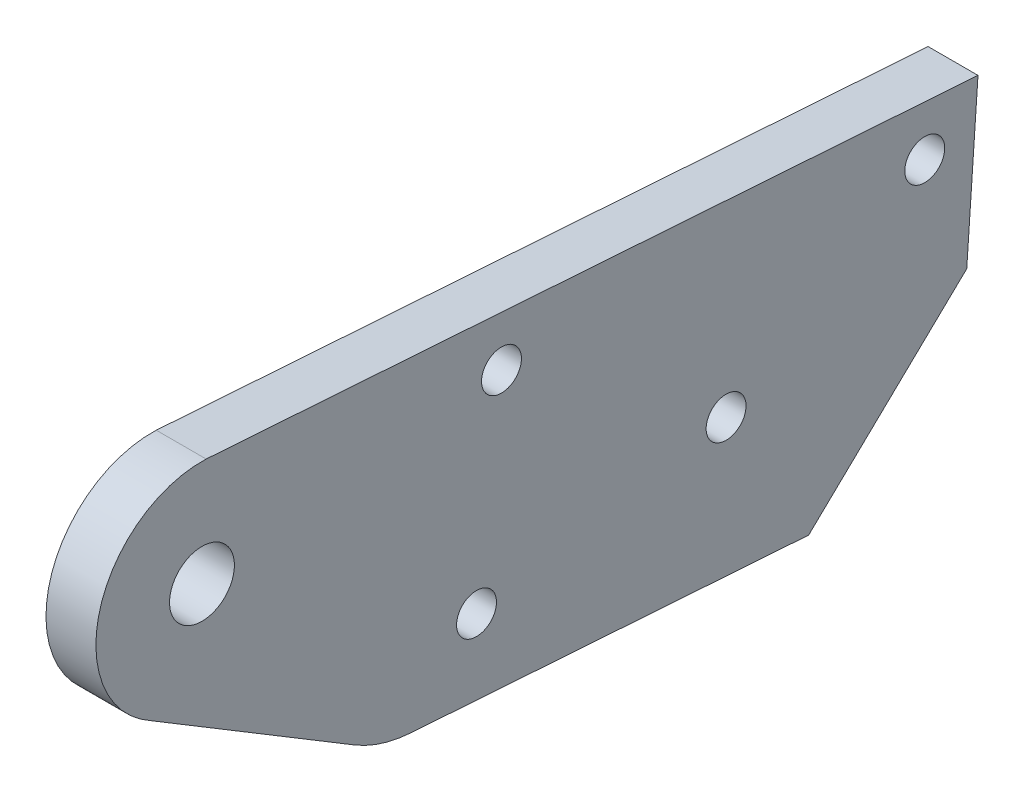
ISO-10303-21;
HEADER;
FILE_DESCRIPTION(('STEP AP214'),'2;1');
FILE_NAME('part.step','',(''),(''),'','','');
FILE_SCHEMA(('AUTOMOTIVE_DESIGN { 1 0 10303 214 1 1 1 1 }'));
ENDSEC;
DATA;
#1=APPLICATION_CONTEXT('core data for automotive mechanical design processes');
#2=APPLICATION_PROTOCOL_DEFINITION('international standard','automotive_design',2000,#1);
#3=PRODUCT_CONTEXT('',#1,'mechanical');
#4=PRODUCT('Part','Part','',(#3));
#5=PRODUCT_RELATED_PRODUCT_CATEGORY('part','',(#4));
#6=PRODUCT_DEFINITION_FORMATION('','',#4);
#7=PRODUCT_DEFINITION_CONTEXT('part definition',#1,'design');
#8=PRODUCT_DEFINITION('design','',#6,#7);
#9=PRODUCT_DEFINITION_SHAPE('','',#8);
#10=(LENGTH_UNIT() NAMED_UNIT(*) SI_UNIT(.MILLI.,.METRE.));
#11=(NAMED_UNIT(*) PLANE_ANGLE_UNIT() SI_UNIT($,.RADIAN.));
#12=(NAMED_UNIT(*) SI_UNIT($,.STERADIAN.) SOLID_ANGLE_UNIT());
#13=UNCERTAINTY_MEASURE_WITH_UNIT(LENGTH_MEASURE(1.E-05),#10,'distance_accuracy_value','');
#14=(GEOMETRIC_REPRESENTATION_CONTEXT(3) GLOBAL_UNCERTAINTY_ASSIGNED_CONTEXT((#13)) GLOBAL_UNIT_ASSIGNED_CONTEXT((#10,
#11,#12)) REPRESENTATION_CONTEXT('',''));
#15=CARTESIAN_POINT('',(0.,0.,0.));
#16=DIRECTION('',(0.,0.,1.));
#17=DIRECTION('',(1.,0.,0.));
#18=AXIS2_PLACEMENT_3D('',#15,#16,#17);
#19=CARTESIAN_POINT('',(4.,11.0855483547425,15.2679604949274));
#20=DIRECTION('',(-1.,0.,0.));
#21=DIRECTION('',(0.,0.,1.));
#22=AXIS2_PLACEMENT_3D('',#19,#20,#21);
#23=PLANE('',#22);
#24=DIRECTION('',(0.,0.997592279399619,-0.0693515975466527));
#25=VECTOR('',#24,1.);
#26=CARTESIAN_POINT('',(4.,24.0097437276074,-29.531620026455));
#27=LINE('',#26,#25);
#28=CARTESIAN_POINT('',(4.,11.0410440954124,-28.6300492583485));
#29=VERTEX_POINT('',#28);
#30=CARTESIAN_POINT('',(4.,24.0097437276074,-29.531620026455));
#31=VERTEX_POINT('',#30);
#32=EDGE_CURVE('E139',#29,#31,#27,.T.);
#33=ORIENTED_EDGE('',*,*,#32,.T.);
#34=DIRECTION('',(0.,0.0693515975466529,0.997592279399619));
#35=VECTOR('',#34,1.);
#36=CARTESIAN_POINT('',(4.,24.0097437276074,-29.531620026455));
#37=LINE('',#36,#35);
#38=CARTESIAN_POINT('',(4.,28.3095427754999,32.3191012963214));
#39=VERTEX_POINT('',#38);
#40=EDGE_CURVE('E92',#31,#39,#37,.T.);
#41=ORIENTED_EDGE('',*,*,#40,.T.);
#42=CARTESIAN_POINT('',(4.,19.8161543742446,32.6542929809171));
#43=DIRECTION('',(1.,0.,0.));
#44=DIRECTION('',(0.,0.,-1.));
#45=AXIS2_PLACEMENT_3D('',#42,#43,#44);
#46=CIRCLE('',#45,8.5);
#47=CARTESIAN_POINT('',(4.,12.3842742548523,36.7794787817001));
#48=VERTEX_POINT('',#47);
#49=EDGE_CURVE('E151',#39,#48,#46,.T.);
#50=ORIENTED_EDGE('',*,*,#49,.T.);
#51=DIRECTION('',(0.,-0.516562038928992,-0.856249764926988));
#52=VECTOR('',#51,1.);
#53=CARTESIAN_POINT('',(4.,2.52305070547264,20.4335808842173));
#54=LINE('',#53,#52);
#55=CARTESIAN_POINT('',(4.,2.52305070547264,20.4335808842173));
#56=VERTEX_POINT('',#55);
#57=EDGE_CURVE('E108',#48,#56,#54,.T.);
#58=ORIENTED_EDGE('',*,*,#57,.T.);
#59=CARTESIAN_POINT('',(4.,11.0855483547425,15.2679604949274));
#60=DIRECTION('',(1.,0.,0.));
#61=DIRECTION('',(0.,0.,1.));
#62=AXIS2_PLACEMENT_3D('',#59,#60,#61);
#63=CIRCLE('',#62,10.);
#64=CARTESIAN_POINT('',(4.,1.10962556074634,15.9614764703939));
#65=VERTEX_POINT('',#64);
#66=EDGE_CURVE('E102',#56,#65,#63,.T.);
#67=ORIENTED_EDGE('',*,*,#66,.T.);
#68=DIRECTION('',(0.,-0.0693515975466525,-0.997592279399619));
#69=VECTOR('',#68,1.);
#70=CARTESIAN_POINT('',(4.,-1.10962556074654,-15.9614764703939));
#71=LINE('',#70,#69);
#72=CARTESIAN_POINT('',(4.,-1.10962556074654,-15.9614764703939));
#73=VERTEX_POINT('',#72);
#74=EDGE_CURVE('E106',#65,#73,#71,.T.);
#75=ORIENTED_EDGE('',*,*,#74,.T.);
#76=DIRECTION('',(0.,0.692200897290571,-0.721704868897342));
#77=VECTOR('',#76,1.);
#78=CARTESIAN_POINT('',(4.,-1.10962556074654,-15.9614764703939));
#79=LINE('',#78,#77);
#80=EDGE_CURVE('E52',#73,#29,#79,.T.);
#81=ORIENTED_EDGE('',*,*,#80,.T.);
#82=EDGE_LOOP('',(#33,#41,#50,#58,#67,#75,#81));
#83=FACE_BOUND('',#82,.T.);
#84=CARTESIAN_POINT('',(4.,20.2967810001956,-25.2638445186699));
#85=DIRECTION('',(1.,0.,0.));
#86=DIRECTION('',(0.,0.,-1.));
#87=AXIS2_PLACEMENT_3D('',#84,#85,#86);
#88=CIRCLE('',#87,1.60000000000001);
#89=CARTESIAN_POINT('',(4.,20.2967810001956,-26.8638445186699));
#90=VERTEX_POINT('',#89);
#91=EDGE_CURVE('E130',#90,#90,#88,.T.);
#92=ORIENTED_EDGE('',*,*,#91,.F.);
#93=EDGE_LOOP('',(#92));
#94=FACE_BOUND('',#93,.T.);
#95=CARTESIAN_POINT('',(4.,22.6547353167818,8.65429298091723));
#96=DIRECTION('',(1.,0.,0.));
#97=DIRECTION('',(0.,0.,-1.));
#98=AXIS2_PLACEMENT_3D('',#95,#96,#97);
#99=CIRCLE('',#98,1.60000000000001);
#100=CARTESIAN_POINT('',(4.,22.6547353167818,7.05429298091722));
#101=VERTEX_POINT('',#100);
#102=EDGE_CURVE('E166',#101,#101,#99,.T.);
#103=ORIENTED_EDGE('',*,*,#102,.F.);
#104=EDGE_LOOP('',(#103));
#105=FACE_BOUND('',#104,.T.);
#106=CARTESIAN_POINT('',(4.,10.3768448310903,-9.34570701908289));
#107=DIRECTION('',(1.,0.,0.));
#108=DIRECTION('',(0.,0.,-1.));
#109=AXIS2_PLACEMENT_3D('',#106,#107,#108);
#110=CIRCLE('',#109,1.60000000000001);
#111=CARTESIAN_POINT('',(4.,10.3768448310903,-10.9457070190829));
#112=VERTEX_POINT('',#111);
#113=EDGE_CURVE('E172',#112,#112,#110,.T.);
#114=ORIENTED_EDGE('',*,*,#113,.F.);
#115=EDGE_LOOP('',(#114));
#116=FACE_BOUND('',#115,.T.);
#117=CARTESIAN_POINT('',(4.,6.75515676906828,10.6542929809171));
#118=DIRECTION('',(1.,0.,0.));
#119=DIRECTION('',(0.,0.,-1.));
#120=AXIS2_PLACEMENT_3D('',#117,#118,#119);
#121=CIRCLE('',#120,1.60000000000001);
#122=CARTESIAN_POINT('',(4.,6.75515676906828,9.0542929809171));
#123=VERTEX_POINT('',#122);
#124=EDGE_CURVE('E178',#123,#123,#121,.T.);
#125=ORIENTED_EDGE('',*,*,#124,.F.);
#126=EDGE_LOOP('',(#125));
#127=FACE_BOUND('',#126,.T.);
#128=CARTESIAN_POINT('',(4.,19.8161543742446,32.6542929809171));
#129=DIRECTION('',(1.,0.,0.));
#130=DIRECTION('',(0.,0.,-1.));
#131=AXIS2_PLACEMENT_3D('',#128,#129,#130);
#132=CIRCLE('',#131,2.6);
#133=CARTESIAN_POINT('',(4.,19.8161543742446,30.0542929809171));
#134=VERTEX_POINT('',#133);
#135=EDGE_CURVE('E184',#134,#134,#132,.T.);
#136=ORIENTED_EDGE('',*,*,#135,.F.);
#137=EDGE_LOOP('',(#136));
#138=FACE_BOUND('',#137,.T.);
#139=ADVANCED_FACE('F35',(#83,#94,#105,#116,#127,#138),#23,.F.);
#140=CARTESIAN_POINT('',(0.,11.0855483547425,15.2679604949274));
#141=DIRECTION('',(-1.,0.,0.));
#142=DIRECTION('',(0.,0.,1.));
#143=AXIS2_PLACEMENT_3D('',#140,#141,#142);
#144=PLANE('',#143);
#145=CARTESIAN_POINT('',(0.,6.75515676906828,10.6542929809171));
#146=DIRECTION('',(1.,0.,0.));
#147=DIRECTION('',(0.,0.,-1.));
#148=AXIS2_PLACEMENT_3D('',#145,#146,#147);
#149=CIRCLE('',#148,1.60000000000001);
#150=CARTESIAN_POINT('',(0.,6.75515676906828,9.0542929809171));
#151=VERTEX_POINT('',#150);
#152=EDGE_CURVE('E181',#151,#151,#149,.T.);
#153=ORIENTED_EDGE('',*,*,#152,.T.);
#154=EDGE_LOOP('',(#153));
#155=FACE_BOUND('',#154,.T.);
#156=CARTESIAN_POINT('',(0.,22.6547353167818,8.65429298091723));
#157=DIRECTION('',(1.,0.,0.));
#158=DIRECTION('',(0.,0.,-1.));
#159=AXIS2_PLACEMENT_3D('',#156,#157,#158);
#160=CIRCLE('',#159,1.60000000000001);
#161=CARTESIAN_POINT('',(0.,22.6547353167818,7.05429298091722));
#162=VERTEX_POINT('',#161);
#163=EDGE_CURVE('E169',#162,#162,#160,.T.);
#164=ORIENTED_EDGE('',*,*,#163,.T.);
#165=EDGE_LOOP('',(#164));
#166=FACE_BOUND('',#165,.T.);
#167=DIRECTION('',(0.,0.997592279399619,-0.0693515975466527));
#168=VECTOR('',#167,1.);
#169=CARTESIAN_POINT('',(0.,24.0097437276074,-29.531620026455));
#170=LINE('',#169,#168);
#171=CARTESIAN_POINT('',(0.,11.0410440954124,-28.6300492583485));
#172=VERTEX_POINT('',#171);
#173=CARTESIAN_POINT('',(0.,24.0097437276074,-29.531620026455));
#174=VERTEX_POINT('',#173);
#175=EDGE_CURVE('E126',#172,#174,#170,.T.);
#176=ORIENTED_EDGE('',*,*,#175,.F.);
#177=DIRECTION('',(0.,0.692200897290571,-0.721704868897342));
#178=VECTOR('',#177,1.);
#179=CARTESIAN_POINT('',(0.,-1.10962556074654,-15.9614764703939));
#180=LINE('',#179,#178);
#181=CARTESIAN_POINT('',(0.,-1.10962556074654,-15.9614764703939));
#182=VERTEX_POINT('',#181);
#183=EDGE_CURVE('E84',#182,#172,#180,.T.);
#184=ORIENTED_EDGE('',*,*,#183,.F.);
#185=DIRECTION('',(0.,-0.0693515975466525,-0.997592279399619));
#186=VECTOR('',#185,1.);
#187=CARTESIAN_POINT('',(0.,-1.10962556074654,-15.9614764703939));
#188=LINE('',#187,#186);
#189=CARTESIAN_POINT('',(0.,1.10962556074634,15.9614764703939));
#190=VERTEX_POINT('',#189);
#191=EDGE_CURVE('E78',#190,#182,#188,.T.);
#192=ORIENTED_EDGE('',*,*,#191,.F.);
#193=CARTESIAN_POINT('',(0.,11.0855483547425,15.2679604949274));
#194=DIRECTION('',(1.,0.,0.));
#195=DIRECTION('',(0.,0.,1.));
#196=AXIS2_PLACEMENT_3D('',#193,#194,#195);
#197=CIRCLE('',#196,10.);
#198=CARTESIAN_POINT('',(0.,2.52305070547264,20.4335808842173));
#199=VERTEX_POINT('',#198);
#200=EDGE_CURVE('E116',#199,#190,#197,.T.);
#201=ORIENTED_EDGE('',*,*,#200,.F.);
#202=DIRECTION('',(0.,-0.516562038928992,-0.856249764926988));
#203=VECTOR('',#202,1.);
#204=CARTESIAN_POINT('',(0.,2.52305070547264,20.4335808842173));
#205=LINE('',#204,#203);
#206=CARTESIAN_POINT('',(0.,12.3842742548523,36.7794787817001));
#207=VERTEX_POINT('',#206);
#208=EDGE_CURVE('E134',#207,#199,#205,.T.);
#209=ORIENTED_EDGE('',*,*,#208,.F.);
#210=CARTESIAN_POINT('',(0.,19.8161543742446,32.6542929809171));
#211=DIRECTION('',(1.,0.,0.));
#212=DIRECTION('',(0.,0.,-1.));
#213=AXIS2_PLACEMENT_3D('',#210,#211,#212);
#214=CIRCLE('',#213,8.5);
#215=CARTESIAN_POINT('',(0.,28.3095427754999,32.3191012963214));
#216=VERTEX_POINT('',#215);
#217=EDGE_CURVE('E132',#216,#207,#214,.T.);
#218=ORIENTED_EDGE('',*,*,#217,.F.);
#219=DIRECTION('',(0.,0.0693515975466529,0.997592279399619));
#220=VECTOR('',#219,1.);
#221=CARTESIAN_POINT('',(0.,24.0097437276074,-29.531620026455));
#222=LINE('',#221,#220);
#223=EDGE_CURVE('E129',#174,#216,#222,.T.);
#224=ORIENTED_EDGE('',*,*,#223,.F.);
#225=EDGE_LOOP('',(#176,#184,#192,#201,#209,#218,#224));
#226=FACE_BOUND('',#225,.T.);
#227=CARTESIAN_POINT('',(0.,20.2967810001956,-25.2638445186699));
#228=DIRECTION('',(1.,0.,0.));
#229=DIRECTION('',(0.,0.,-1.));
#230=AXIS2_PLACEMENT_3D('',#227,#228,#229);
#231=CIRCLE('',#230,1.60000000000001);
#232=CARTESIAN_POINT('',(0.,20.2967810001956,-26.8638445186699));
#233=VERTEX_POINT('',#232);
#234=EDGE_CURVE('E163',#233,#233,#231,.T.);
#235=ORIENTED_EDGE('',*,*,#234,.T.);
#236=EDGE_LOOP('',(#235));
#237=FACE_BOUND('',#236,.T.);
#238=CARTESIAN_POINT('',(0.,10.3768448310903,-9.34570701908289));
#239=DIRECTION('',(1.,0.,0.));
#240=DIRECTION('',(0.,0.,-1.));
#241=AXIS2_PLACEMENT_3D('',#238,#239,#240);
#242=CIRCLE('',#241,1.60000000000001);
#243=CARTESIAN_POINT('',(0.,10.3768448310903,-10.9457070190829));
#244=VERTEX_POINT('',#243);
#245=EDGE_CURVE('E175',#244,#244,#242,.T.);
#246=ORIENTED_EDGE('',*,*,#245,.T.);
#247=EDGE_LOOP('',(#246));
#248=FACE_BOUND('',#247,.T.);
#249=CARTESIAN_POINT('',(0.,19.8161543742446,32.6542929809171));
#250=DIRECTION('',(1.,0.,0.));
#251=DIRECTION('',(0.,0.,-1.));
#252=AXIS2_PLACEMENT_3D('',#249,#250,#251);
#253=CIRCLE('',#252,2.6);
#254=CARTESIAN_POINT('',(0.,19.8161543742446,30.0542929809171));
#255=VERTEX_POINT('',#254);
#256=EDGE_CURVE('E187',#255,#255,#253,.T.);
#257=ORIENTED_EDGE('',*,*,#256,.T.);
#258=EDGE_LOOP('',(#257));
#259=FACE_BOUND('',#258,.T.);
#260=ADVANCED_FACE('F155',(#155,#166,#226,#237,#248,#259),#144,.T.);
#261=CARTESIAN_POINT('',(4.,24.0097437276074,-29.531620026455));
#262=DIRECTION('',(0.,0.0693515975466527,0.997592279399619));
#263=DIRECTION('',(0.,-0.997592279399619,0.0693515975466527));
#264=AXIS2_PLACEMENT_3D('',#261,#262,#263);
#265=PLANE('',#264);
#266=ORIENTED_EDGE('',*,*,#175,.T.);
#267=DIRECTION('',(-1.,0.,0.));
#268=VECTOR('',#267,1.);
#269=CARTESIAN_POINT('',(4.,24.0097437276074,-29.531620026455));
#270=LINE('',#269,#268);
#271=EDGE_CURVE('E11',#31,#174,#270,.T.);
#272=ORIENTED_EDGE('',*,*,#271,.F.);
#273=ORIENTED_EDGE('',*,*,#32,.F.);
#274=DIRECTION('',(-1.,0.,0.));
#275=VECTOR('',#274,1.);
#276=CARTESIAN_POINT('',(4.,11.0410440954124,-28.6300492583485));
#277=LINE('',#276,#275);
#278=EDGE_CURVE('E122',#29,#172,#277,.T.);
#279=ORIENTED_EDGE('',*,*,#278,.T.);
#280=EDGE_LOOP('',(#266,#272,#273,#279));
#281=FACE_BOUND('',#280,.T.);
#282=ADVANCED_FACE('F37',(#281),#265,.F.);
#283=CARTESIAN_POINT('',(4.,24.0097437276074,-29.531620026455));
#284=DIRECTION('',(0.,-0.997592279399619,0.0693515975466529));
#285=DIRECTION('',(0.,-0.0693515975466529,-0.997592279399619));
#286=AXIS2_PLACEMENT_3D('',#283,#284,#285);
#287=PLANE('',#286);
#288=ORIENTED_EDGE('',*,*,#223,.T.);
#289=DIRECTION('',(-1.,0.,0.));
#290=VECTOR('',#289,1.);
#291=CARTESIAN_POINT('',(4.,28.3095427754999,32.3191012963214));
#292=LINE('',#291,#290);
#293=EDGE_CURVE('E44',#39,#216,#292,.T.);
#294=ORIENTED_EDGE('',*,*,#293,.F.);
#295=ORIENTED_EDGE('',*,*,#40,.F.);
#296=ORIENTED_EDGE('',*,*,#271,.T.);
#297=EDGE_LOOP('',(#288,#294,#295,#296));
#298=FACE_BOUND('',#297,.T.);
#299=ADVANCED_FACE('F217',(#298),#287,.F.);
#300=CARTESIAN_POINT('',(4.,19.8161543742446,32.6542929809171));
#301=DIRECTION('',(-1.,0.,0.));
#302=DIRECTION('',(0.,0.,1.));
#303=AXIS2_PLACEMENT_3D('',#300,#301,#302);
#304=CYLINDRICAL_SURFACE('',#303,8.5);
#305=ORIENTED_EDGE('',*,*,#217,.T.);
#306=DIRECTION('',(-1.,0.,0.));
#307=VECTOR('',#306,1.);
#308=CARTESIAN_POINT('',(4.,12.3842742548523,36.7794787817001));
#309=LINE('',#308,#307);
#310=EDGE_CURVE('E143',#48,#207,#309,.T.);
#311=ORIENTED_EDGE('',*,*,#310,.F.);
#312=ORIENTED_EDGE('',*,*,#49,.F.);
#313=ORIENTED_EDGE('',*,*,#293,.T.);
#314=EDGE_LOOP('',(#305,#311,#312,#313));
#315=FACE_BOUND('',#314,.T.);
#316=ADVANCED_FACE('F149',(#315),#304,.T.);
#317=CARTESIAN_POINT('',(4.,2.52305070547264,20.4335808842173));
#318=DIRECTION('',(0.,0.856249764926988,-0.516562038928992));
#319=DIRECTION('',(0.,0.516562038928992,0.856249764926988));
#320=AXIS2_PLACEMENT_3D('',#317,#318,#319);
#321=PLANE('',#320);
#322=ORIENTED_EDGE('',*,*,#208,.T.);
#323=DIRECTION('',(-1.,0.,0.));
#324=VECTOR('',#323,1.);
#325=CARTESIAN_POINT('',(4.,2.52305070547264,20.4335808842173));
#326=LINE('',#325,#324);
#327=EDGE_CURVE('E117',#56,#199,#326,.T.);
#328=ORIENTED_EDGE('',*,*,#327,.F.);
#329=ORIENTED_EDGE('',*,*,#57,.F.);
#330=ORIENTED_EDGE('',*,*,#310,.T.);
#331=EDGE_LOOP('',(#322,#328,#329,#330));
#332=FACE_BOUND('',#331,.T.);
#333=ADVANCED_FACE('F158',(#332),#321,.F.);
#334=CARTESIAN_POINT('',(4.,11.0855483547425,15.2679604949274));
#335=DIRECTION('',(-1.,0.,0.));
#336=DIRECTION('',(0.,0.,1.));
#337=AXIS2_PLACEMENT_3D('',#334,#335,#336);
#338=CYLINDRICAL_SURFACE('',#337,10.);
#339=ORIENTED_EDGE('',*,*,#200,.T.);
#340=DIRECTION('',(-1.,0.,0.));
#341=VECTOR('',#340,1.);
#342=CARTESIAN_POINT('',(4.,1.10962556074634,15.9614764703939));
#343=LINE('',#342,#341);
#344=EDGE_CURVE('E113',#65,#190,#343,.T.);
#345=ORIENTED_EDGE('',*,*,#344,.F.);
#346=ORIENTED_EDGE('',*,*,#66,.F.);
#347=ORIENTED_EDGE('',*,*,#327,.T.);
#348=EDGE_LOOP('',(#339,#345,#346,#347));
#349=FACE_BOUND('',#348,.T.);
#350=ADVANCED_FACE('F114',(#349),#338,.T.);
#351=CARTESIAN_POINT('',(4.,-1.10962556074654,-15.9614764703939));
#352=DIRECTION('',(0.,0.997592279399619,-0.0693515975466525));
#353=DIRECTION('',(0.,0.0693515975466525,0.997592279399619));
#354=AXIS2_PLACEMENT_3D('',#351,#352,#353);
#355=PLANE('',#354);
#356=ORIENTED_EDGE('',*,*,#191,.T.);
#357=DIRECTION('',(-1.,0.,0.));
#358=VECTOR('',#357,1.);
#359=CARTESIAN_POINT('',(4.,-1.10962556074654,-15.9614764703939));
#360=LINE('',#359,#358);
#361=EDGE_CURVE('E118',#73,#182,#360,.T.);
#362=ORIENTED_EDGE('',*,*,#361,.F.);
#363=ORIENTED_EDGE('',*,*,#74,.F.);
#364=ORIENTED_EDGE('',*,*,#344,.T.);
#365=EDGE_LOOP('',(#356,#362,#363,#364));
#366=FACE_BOUND('',#365,.T.);
#367=ADVANCED_FACE('F120',(#366),#355,.F.);
#368=CARTESIAN_POINT('',(4.,-1.10962556074654,-15.9614764703939));
#369=DIRECTION('',(0.,0.721704868897342,0.692200897290571));
#370=DIRECTION('',(0.,-0.692200897290571,0.721704868897342));
#371=AXIS2_PLACEMENT_3D('',#368,#369,#370);
#372=PLANE('',#371);
#373=ORIENTED_EDGE('',*,*,#183,.T.);
#374=ORIENTED_EDGE('',*,*,#278,.F.);
#375=ORIENTED_EDGE('',*,*,#80,.F.);
#376=ORIENTED_EDGE('',*,*,#361,.T.);
#377=EDGE_LOOP('',(#373,#374,#375,#376));
#378=FACE_BOUND('',#377,.T.);
#379=ADVANCED_FACE('F207',(#378),#372,.F.);
#380=CARTESIAN_POINT('',(4.,20.2967810001956,-25.2638445186699));
#381=DIRECTION('',(-1.,0.,0.));
#382=DIRECTION('',(0.,0.,1.));
#383=AXIS2_PLACEMENT_3D('',#380,#381,#382);
#384=CYLINDRICAL_SURFACE('',#383,1.60000000000001);
#385=ORIENTED_EDGE('',*,*,#91,.T.);
#386=EDGE_LOOP('',(#385));
#387=FACE_BOUND('',#386,.T.);
#388=ORIENTED_EDGE('',*,*,#234,.F.);
#389=EDGE_LOOP('',(#388));
#390=FACE_BOUND('',#389,.T.);
#391=ADVANCED_FACE('F204',(#387,#390),#384,.F.);
#392=CARTESIAN_POINT('',(4.,22.6547353167818,8.65429298091723));
#393=DIRECTION('',(-1.,0.,0.));
#394=DIRECTION('',(0.,0.,1.));
#395=AXIS2_PLACEMENT_3D('',#392,#393,#394);
#396=CYLINDRICAL_SURFACE('',#395,1.60000000000001);
#397=ORIENTED_EDGE('',*,*,#102,.T.);
#398=EDGE_LOOP('',(#397));
#399=FACE_BOUND('',#398,.T.);
#400=ORIENTED_EDGE('',*,*,#163,.F.);
#401=EDGE_LOOP('',(#400));
#402=FACE_BOUND('',#401,.T.);
#403=ADVANCED_FACE('F276',(#399,#402),#396,.F.);
#404=CARTESIAN_POINT('',(4.,10.3768448310903,-9.34570701908289));
#405=DIRECTION('',(-1.,0.,0.));
#406=DIRECTION('',(0.,0.,1.));
#407=AXIS2_PLACEMENT_3D('',#404,#405,#406);
#408=CYLINDRICAL_SURFACE('',#407,1.60000000000001);
#409=ORIENTED_EDGE('',*,*,#113,.T.);
#410=EDGE_LOOP('',(#409));
#411=FACE_BOUND('',#410,.T.);
#412=ORIENTED_EDGE('',*,*,#245,.F.);
#413=EDGE_LOOP('',(#412));
#414=FACE_BOUND('',#413,.T.);
#415=ADVANCED_FACE('F284',(#411,#414),#408,.F.);
#416=CARTESIAN_POINT('',(4.,6.75515676906828,10.6542929809171));
#417=DIRECTION('',(-1.,0.,0.));
#418=DIRECTION('',(0.,0.,1.));
#419=AXIS2_PLACEMENT_3D('',#416,#417,#418);
#420=CYLINDRICAL_SURFACE('',#419,1.60000000000001);
#421=ORIENTED_EDGE('',*,*,#124,.T.);
#422=EDGE_LOOP('',(#421));
#423=FACE_BOUND('',#422,.T.);
#424=ORIENTED_EDGE('',*,*,#152,.F.);
#425=EDGE_LOOP('',(#424));
#426=FACE_BOUND('',#425,.T.);
#427=ADVANCED_FACE('F292',(#423,#426),#420,.F.);
#428=CARTESIAN_POINT('',(4.,19.8161543742446,32.6542929809171));
#429=DIRECTION('',(-1.,0.,0.));
#430=DIRECTION('',(0.,0.,1.));
#431=AXIS2_PLACEMENT_3D('',#428,#429,#430);
#432=CYLINDRICAL_SURFACE('',#431,2.6);
#433=ORIENTED_EDGE('',*,*,#135,.T.);
#434=EDGE_LOOP('',(#433));
#435=FACE_BOUND('',#434,.T.);
#436=ORIENTED_EDGE('',*,*,#256,.F.);
#437=EDGE_LOOP('',(#436));
#438=FACE_BOUND('',#437,.T.);
#439=ADVANCED_FACE('F193',(#435,#438),#432,.F.);
#440=CLOSED_SHELL('',(#139,#260,#282,#299,#316,#333,#350,#367,#379,#391,#403,#415,#427,#439));
#441=MANIFOLD_SOLID_BREP('B2',#440);
#442=ADVANCED_BREP_SHAPE_REPRESENTATION('',(#18,#441),#14);
#443=SHAPE_DEFINITION_REPRESENTATION(#9,#442);
ENDSEC;
END-ISO-10303-21;
